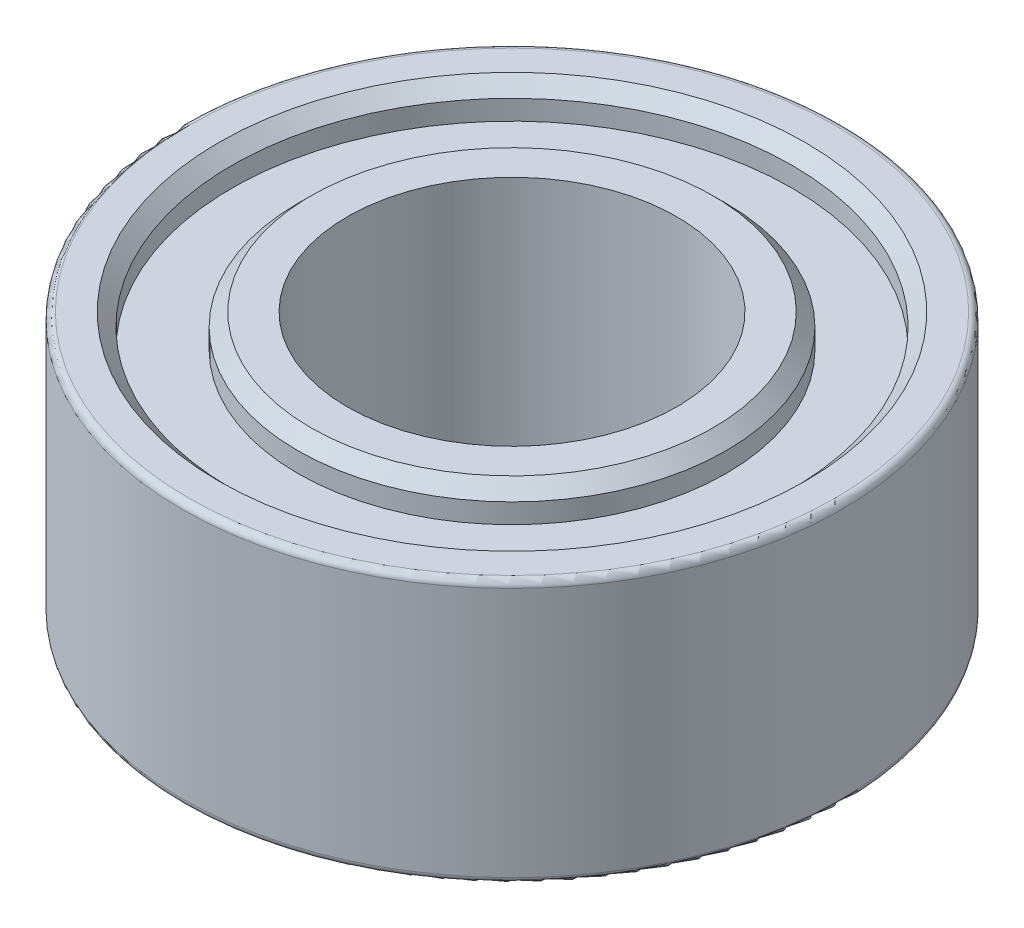
ISO-10303-21;
HEADER;
FILE_DESCRIPTION(('STEP AP214'),'2;1');
FILE_NAME('part.step','',(''),(''),'','','');
FILE_SCHEMA(('AUTOMOTIVE_DESIGN { 1 0 10303 214 1 1 1 1 }'));
ENDSEC;
DATA;
#1=APPLICATION_CONTEXT('core data for automotive mechanical design processes');
#2=APPLICATION_PROTOCOL_DEFINITION('international standard','automotive_design',2000,#1);
#3=PRODUCT_CONTEXT('',#1,'mechanical');
#4=PRODUCT('Part','Part','',(#3));
#5=PRODUCT_RELATED_PRODUCT_CATEGORY('part','',(#4));
#6=PRODUCT_DEFINITION_FORMATION('','',#4);
#7=PRODUCT_DEFINITION_CONTEXT('part definition',#1,'design');
#8=PRODUCT_DEFINITION('design','',#6,#7);
#9=PRODUCT_DEFINITION_SHAPE('','',#8);
#10=(LENGTH_UNIT() NAMED_UNIT(*) SI_UNIT(.MILLI.,.METRE.));
#11=(NAMED_UNIT(*) PLANE_ANGLE_UNIT() SI_UNIT($,.RADIAN.));
#12=(NAMED_UNIT(*) SI_UNIT($,.STERADIAN.) SOLID_ANGLE_UNIT());
#13=UNCERTAINTY_MEASURE_WITH_UNIT(LENGTH_MEASURE(1.E-05),#10,'distance_accuracy_value','');
#14=(GEOMETRIC_REPRESENTATION_CONTEXT(3) GLOBAL_UNCERTAINTY_ASSIGNED_CONTEXT((#13)) GLOBAL_UNIT_ASSIGNED_CONTEXT((#10,
#11,#12)) REPRESENTATION_CONTEXT('',''));
#15=CARTESIAN_POINT('',(0.,0.,0.));
#16=DIRECTION('',(0.,0.,1.));
#17=DIRECTION('',(1.,0.,0.));
#18=AXIS2_PLACEMENT_3D('',#15,#16,#17);
#19=CARTESIAN_POINT('',(0.,-2.,0.));
#20=DIRECTION('',(0.,1.,0.));
#21=DIRECTION('',(0.,0.,1.));
#22=AXIS2_PLACEMENT_3D('',#19,#20,#21);
#23=PLANE('',#22);
#24=CARTESIAN_POINT('',(0.,-2.,0.));
#25=DIRECTION('',(0.,1.,0.));
#26=DIRECTION('',(0.,0.,1.));
#27=AXIS2_PLACEMENT_3D('',#24,#25,#26);
#28=CIRCLE('',#27,3.05);
#29=CARTESIAN_POINT('',(0.,-2.,3.05));
#30=VERTEX_POINT('',#29);
#31=EDGE_CURVE('E79',#30,#30,#28,.F.);
#32=ORIENTED_EDGE('',*,*,#31,.T.);
#33=EDGE_LOOP('',(#32));
#34=FACE_BOUND('',#33,.T.);
#35=CARTESIAN_POINT('',(0.,-2.,0.));
#36=DIRECTION('',(0.,1.,0.));
#37=DIRECTION('',(0.,0.,1.));
#38=AXIS2_PLACEMENT_3D('',#35,#36,#37);
#39=CIRCLE('',#38,2.5);
#40=CARTESIAN_POINT('',(0.,-2.,2.5));
#41=VERTEX_POINT('',#40);
#42=EDGE_CURVE('E96',#41,#41,#39,.T.);
#43=ORIENTED_EDGE('',*,*,#42,.T.);
#44=EDGE_LOOP('',(#43));
#45=FACE_BOUND('',#44,.T.);
#46=ADVANCED_FACE('F39',(#34,#45),#23,.F.);
#47=CARTESIAN_POINT('',(0.,2.,0.));
#48=DIRECTION('',(0.,1.,0.));
#49=DIRECTION('',(0.,0.,1.));
#50=AXIS2_PLACEMENT_3D('',#47,#48,#49);
#51=PLANE('',#50);
#52=CARTESIAN_POINT('',(0.,2.,0.));
#53=DIRECTION('',(0.,1.,0.));
#54=DIRECTION('',(0.,0.,1.));
#55=AXIS2_PLACEMENT_3D('',#52,#53,#54);
#56=CIRCLE('',#55,3.05);
#57=CARTESIAN_POINT('',(0.,2.,3.05));
#58=VERTEX_POINT('',#57);
#59=EDGE_CURVE('E75',#58,#58,#56,.T.);
#60=ORIENTED_EDGE('',*,*,#59,.T.);
#61=EDGE_LOOP('',(#60));
#62=FACE_BOUND('',#61,.T.);
#63=CARTESIAN_POINT('',(0.,2.,0.));
#64=DIRECTION('',(0.,1.,0.));
#65=DIRECTION('',(0.,0.,1.));
#66=AXIS2_PLACEMENT_3D('',#63,#64,#65);
#67=CIRCLE('',#66,2.5);
#68=CARTESIAN_POINT('',(0.,2.,2.5));
#69=VERTEX_POINT('',#68);
#70=EDGE_CURVE('E95',#69,#69,#67,.T.);
#71=ORIENTED_EDGE('',*,*,#70,.F.);
#72=EDGE_LOOP('',(#71));
#73=FACE_BOUND('',#72,.T.);
#74=ADVANCED_FACE('F139',(#62,#73),#51,.T.);
#75=CARTESIAN_POINT('',(0.,2.,0.));
#76=DIRECTION('',(0.,1.,0.));
#77=DIRECTION('',(0.,0.,1.));
#78=AXIS2_PLACEMENT_3D('',#75,#76,#77);
#79=CIRCLE('',#78,4.9);
#80=CARTESIAN_POINT('',(0.,2.,4.9));
#81=VERTEX_POINT('',#80);
#82=EDGE_CURVE('E10',#81,#81,#79,.T.);
#83=ORIENTED_EDGE('',*,*,#82,.T.);
#84=EDGE_LOOP('',(#83));
#85=FACE_BOUND('',#84,.T.);
#86=CARTESIAN_POINT('',(0.,2.,0.));
#87=DIRECTION('',(0.,1.,0.));
#88=DIRECTION('',(0.,0.,1.));
#89=AXIS2_PLACEMENT_3D('',#86,#87,#88);
#90=CIRCLE('',#89,4.45);
#91=CARTESIAN_POINT('',(0.,2.,4.45));
#92=VERTEX_POINT('',#91);
#93=EDGE_CURVE('E63',#92,#92,#90,.F.);
#94=ORIENTED_EDGE('',*,*,#93,.T.);
#95=EDGE_LOOP('',(#94));
#96=FACE_BOUND('',#95,.T.);
#97=ADVANCED_FACE('F146',(#85,#96),#51,.T.);
#98=CARTESIAN_POINT('',(0.,-2.,0.));
#99=DIRECTION('',(0.,1.,0.));
#100=DIRECTION('',(0.,0.,1.));
#101=AXIS2_PLACEMENT_3D('',#98,#99,#100);
#102=CIRCLE('',#101,4.9);
#103=CARTESIAN_POINT('',(0.,-2.,4.9));
#104=VERTEX_POINT('',#103);
#105=EDGE_CURVE('E47',#104,#104,#102,.F.);
#106=ORIENTED_EDGE('',*,*,#105,.T.);
#107=EDGE_LOOP('',(#106));
#108=FACE_BOUND('',#107,.T.);
#109=CARTESIAN_POINT('',(0.,-2.,0.));
#110=DIRECTION('',(0.,1.,0.));
#111=DIRECTION('',(0.,0.,1.));
#112=AXIS2_PLACEMENT_3D('',#109,#110,#111);
#113=CIRCLE('',#112,4.45);
#114=CARTESIAN_POINT('',(0.,-2.,4.45));
#115=VERTEX_POINT('',#114);
#116=EDGE_CURVE('E91',#115,#115,#113,.T.);
#117=ORIENTED_EDGE('',*,*,#116,.T.);
#118=EDGE_LOOP('',(#117));
#119=FACE_BOUND('',#118,.T.);
#120=ADVANCED_FACE('F142',(#108,#119),#23,.F.);
#121=CARTESIAN_POINT('',(0.,2.,0.));
#122=DIRECTION('',(0.,-1.,0.));
#123=DIRECTION('',(0.,0.,-1.));
#124=AXIS2_PLACEMENT_3D('',#121,#122,#123);
#125=CYLINDRICAL_SURFACE('',#124,5.);
#126=CARTESIAN_POINT('',(0.,-1.9,0.));
#127=DIRECTION('',(0.,1.,0.));
#128=DIRECTION('',(0.,0.,1.));
#129=AXIS2_PLACEMENT_3D('',#126,#127,#128);
#130=CIRCLE('',#129,5.);
#131=CARTESIAN_POINT('',(0.,-1.9,5.));
#132=VERTEX_POINT('',#131);
#133=EDGE_CURVE('E52',#132,#132,#130,.T.);
#134=ORIENTED_EDGE('',*,*,#133,.T.);
#135=EDGE_LOOP('',(#134));
#136=FACE_BOUND('',#135,.T.);
#137=CARTESIAN_POINT('',(0.,1.9,0.));
#138=DIRECTION('',(0.,1.,0.));
#139=DIRECTION('',(0.,0.,1.));
#140=AXIS2_PLACEMENT_3D('',#137,#138,#139);
#141=CIRCLE('',#140,5.);
#142=CARTESIAN_POINT('',(0.,1.9,5.));
#143=VERTEX_POINT('',#142);
#144=EDGE_CURVE('E57',#143,#143,#141,.F.);
#145=ORIENTED_EDGE('',*,*,#144,.T.);
#146=EDGE_LOOP('',(#145));
#147=FACE_BOUND('',#146,.T.);
#148=ADVANCED_FACE('F152',(#136,#147),#125,.T.);
#149=CARTESIAN_POINT('',(0.,2.,0.));
#150=DIRECTION('',(0.,-1.,0.));
#151=DIRECTION('',(0.,0.,-1.));
#152=AXIS2_PLACEMENT_3D('',#149,#150,#151);
#153=CYLINDRICAL_SURFACE('',#152,2.5);
#154=ORIENTED_EDGE('',*,*,#70,.T.);
#155=EDGE_LOOP('',(#154));
#156=FACE_BOUND('',#155,.T.);
#157=ORIENTED_EDGE('',*,*,#42,.F.);
#158=EDGE_LOOP('',(#157));
#159=FACE_BOUND('',#158,.T.);
#160=ADVANCED_FACE('F157',(#156,#159),#153,.F.);
#161=CARTESIAN_POINT('',(0.,1.5,0.));
#162=DIRECTION('',(0.,1.,0.));
#163=DIRECTION('',(0.,0.,1.));
#164=AXIS2_PLACEMENT_3D('',#161,#162,#163);
#165=CYLINDRICAL_SURFACE('',#164,4.25);
#166=CARTESIAN_POINT('',(0.,1.8,0.));
#167=DIRECTION('',(0.,1.,0.));
#168=DIRECTION('',(0.,0.,1.));
#169=AXIS2_PLACEMENT_3D('',#166,#167,#168);
#170=CIRCLE('',#169,4.25);
#171=CARTESIAN_POINT('',(0.,1.8,4.25));
#172=VERTEX_POINT('',#171);
#173=EDGE_CURVE('E67',#172,#172,#170,.T.);
#174=ORIENTED_EDGE('',*,*,#173,.T.);
#175=EDGE_LOOP('',(#174));
#176=FACE_BOUND('',#175,.T.);
#177=CARTESIAN_POINT('',(0.,1.5,0.));
#178=DIRECTION('',(0.,1.,0.));
#179=DIRECTION('',(0.,0.,1.));
#180=AXIS2_PLACEMENT_3D('',#177,#178,#179);
#181=CIRCLE('',#180,4.25);
#182=CARTESIAN_POINT('',(0.,1.5,4.25));
#183=VERTEX_POINT('',#182);
#184=EDGE_CURVE('E100',#183,#183,#181,.T.);
#185=ORIENTED_EDGE('',*,*,#184,.F.);
#186=EDGE_LOOP('',(#185));
#187=FACE_BOUND('',#186,.T.);
#188=ADVANCED_FACE('F168',(#176,#187),#165,.F.);
#189=CARTESIAN_POINT('',(0.,1.5,0.));
#190=DIRECTION('',(0.,1.,0.));
#191=DIRECTION('',(0.,0.,1.));
#192=AXIS2_PLACEMENT_3D('',#189,#190,#191);
#193=PLANE('',#192);
#194=CARTESIAN_POINT('',(0.,1.5,0.));
#195=DIRECTION('',(0.,1.,0.));
#196=DIRECTION('',(0.,0.,1.));
#197=AXIS2_PLACEMENT_3D('',#194,#195,#196);
#198=CIRCLE('',#197,3.25);
#199=CARTESIAN_POINT('',(0.,1.5,3.25));
#200=VERTEX_POINT('',#199);
#201=EDGE_CURVE('E107',#200,#200,#198,.T.);
#202=ORIENTED_EDGE('',*,*,#201,.F.);
#203=EDGE_LOOP('',(#202));
#204=FACE_BOUND('',#203,.T.);
#205=ORIENTED_EDGE('',*,*,#184,.T.);
#206=EDGE_LOOP('',(#205));
#207=FACE_BOUND('',#206,.T.);
#208=ADVANCED_FACE('F172',(#204,#207),#193,.T.);
#209=CARTESIAN_POINT('',(0.,1.5,0.));
#210=DIRECTION('',(0.,1.,0.));
#211=DIRECTION('',(0.,0.,1.));
#212=AXIS2_PLACEMENT_3D('',#209,#210,#211);
#213=CYLINDRICAL_SURFACE('',#212,3.25);
#214=CARTESIAN_POINT('',(0.,1.8,0.));
#215=DIRECTION('',(0.,1.,0.));
#216=DIRECTION('',(0.,0.,1.));
#217=AXIS2_PLACEMENT_3D('',#214,#215,#216);
#218=CIRCLE('',#217,3.25);
#219=CARTESIAN_POINT('',(0.,1.8,3.25));
#220=VERTEX_POINT('',#219);
#221=EDGE_CURVE('E71',#220,#220,#218,.F.);
#222=ORIENTED_EDGE('',*,*,#221,.T.);
#223=EDGE_LOOP('',(#222));
#224=FACE_BOUND('',#223,.T.);
#225=ORIENTED_EDGE('',*,*,#201,.T.);
#226=EDGE_LOOP('',(#225));
#227=FACE_BOUND('',#226,.T.);
#228=ADVANCED_FACE('F176',(#224,#227),#213,.T.);
#229=CARTESIAN_POINT('',(0.,-1.5,0.));
#230=DIRECTION('',(0.,-1.,0.));
#231=DIRECTION('',(0.,0.,1.));
#232=AXIS2_PLACEMENT_3D('',#229,#230,#231);
#233=PLANE('',#232);
#234=CARTESIAN_POINT('',(0.,-1.5,0.));
#235=DIRECTION('',(0.,1.,0.));
#236=DIRECTION('',(0.,0.,1.));
#237=AXIS2_PLACEMENT_3D('',#234,#235,#236);
#238=CIRCLE('',#237,4.25);
#239=CARTESIAN_POINT('',(0.,-1.5,4.25));
#240=VERTEX_POINT('',#239);
#241=EDGE_CURVE('E111',#240,#240,#238,.T.);
#242=ORIENTED_EDGE('',*,*,#241,.F.);
#243=EDGE_LOOP('',(#242));
#244=FACE_BOUND('',#243,.T.);
#245=CARTESIAN_POINT('',(0.,-1.5,0.));
#246=DIRECTION('',(0.,1.,0.));
#247=DIRECTION('',(0.,0.,1.));
#248=AXIS2_PLACEMENT_3D('',#245,#246,#247);
#249=CIRCLE('',#248,3.25);
#250=CARTESIAN_POINT('',(0.,-1.5,3.25));
#251=VERTEX_POINT('',#250);
#252=EDGE_CURVE('E115',#251,#251,#249,.T.);
#253=ORIENTED_EDGE('',*,*,#252,.T.);
#254=EDGE_LOOP('',(#253));
#255=FACE_BOUND('',#254,.T.);
#256=ADVANCED_FACE('F120',(#244,#255),#233,.T.);
#257=CARTESIAN_POINT('',(0.,-1.5,0.));
#258=DIRECTION('',(0.,-1.,0.));
#259=DIRECTION('',(0.,0.,-1.));
#260=AXIS2_PLACEMENT_3D('',#257,#258,#259);
#261=CYLINDRICAL_SURFACE('',#260,4.25);
#262=CARTESIAN_POINT('',(0.,-1.8,0.));
#263=DIRECTION('',(0.,1.,0.));
#264=DIRECTION('',(0.,0.,1.));
#265=AXIS2_PLACEMENT_3D('',#262,#263,#264);
#266=CIRCLE('',#265,4.25);
#267=CARTESIAN_POINT('',(0.,-1.8,4.25));
#268=VERTEX_POINT('',#267);
#269=EDGE_CURVE('E87',#268,#268,#266,.F.);
#270=ORIENTED_EDGE('',*,*,#269,.T.);
#271=EDGE_LOOP('',(#270));
#272=FACE_BOUND('',#271,.T.);
#273=ORIENTED_EDGE('',*,*,#241,.T.);
#274=EDGE_LOOP('',(#273));
#275=FACE_BOUND('',#274,.T.);
#276=ADVANCED_FACE('F125',(#272,#275),#261,.F.);
#277=CARTESIAN_POINT('',(0.,-1.5,0.));
#278=DIRECTION('',(0.,-1.,0.));
#279=DIRECTION('',(0.,0.,-1.));
#280=AXIS2_PLACEMENT_3D('',#277,#278,#279);
#281=CYLINDRICAL_SURFACE('',#280,3.25);
#282=CARTESIAN_POINT('',(0.,-1.8,0.));
#283=DIRECTION('',(0.,1.,0.));
#284=DIRECTION('',(0.,0.,1.));
#285=AXIS2_PLACEMENT_3D('',#282,#283,#284);
#286=CIRCLE('',#285,3.25);
#287=CARTESIAN_POINT('',(0.,-1.8,3.25));
#288=VERTEX_POINT('',#287);
#289=EDGE_CURVE('E83',#288,#288,#286,.T.);
#290=ORIENTED_EDGE('',*,*,#289,.T.);
#291=EDGE_LOOP('',(#290));
#292=FACE_BOUND('',#291,.T.);
#293=ORIENTED_EDGE('',*,*,#252,.F.);
#294=EDGE_LOOP('',(#293));
#295=FACE_BOUND('',#294,.T.);
#296=ADVANCED_FACE('F122',(#292,#295),#281,.T.);
#297=CARTESIAN_POINT('',(0.,-2.,0.));
#298=DIRECTION('',(0.,-1.,0.));
#299=DIRECTION('',(0.,0.,-1.));
#300=AXIS2_PLACEMENT_3D('',#297,#298,#299);
#301=CONICAL_SURFACE('',#300,4.45,0.785398163397444);
#302=ORIENTED_EDGE('',*,*,#269,.F.);
#303=EDGE_LOOP('',(#302));
#304=FACE_BOUND('',#303,.T.);
#305=ORIENTED_EDGE('',*,*,#116,.F.);
#306=EDGE_LOOP('',(#305));
#307=FACE_BOUND('',#306,.T.);
#308=ADVANCED_FACE('F124',(#304,#307),#301,.F.);
#309=CARTESIAN_POINT('',(0.,-1.8,0.));
#310=DIRECTION('',(0.,1.,0.));
#311=DIRECTION('',(0.,0.,1.));
#312=AXIS2_PLACEMENT_3D('',#309,#310,#311);
#313=CONICAL_SURFACE('',#312,3.25,0.78539816339745);
#314=ORIENTED_EDGE('',*,*,#31,.F.);
#315=EDGE_LOOP('',(#314));
#316=FACE_BOUND('',#315,.T.);
#317=ORIENTED_EDGE('',*,*,#289,.F.);
#318=EDGE_LOOP('',(#317));
#319=FACE_BOUND('',#318,.T.);
#320=ADVANCED_FACE('F132',(#316,#319),#313,.T.);
#321=CARTESIAN_POINT('',(0.,2.,0.));
#322=DIRECTION('',(0.,-1.,0.));
#323=DIRECTION('',(0.,0.,-1.));
#324=AXIS2_PLACEMENT_3D('',#321,#322,#323);
#325=CONICAL_SURFACE('',#324,3.05,0.785398163397444);
#326=ORIENTED_EDGE('',*,*,#221,.F.);
#327=EDGE_LOOP('',(#326));
#328=FACE_BOUND('',#327,.T.);
#329=ORIENTED_EDGE('',*,*,#59,.F.);
#330=EDGE_LOOP('',(#329));
#331=FACE_BOUND('',#330,.T.);
#332=ADVANCED_FACE('F215',(#328,#331),#325,.T.);
#333=CARTESIAN_POINT('',(0.,1.8,0.));
#334=DIRECTION('',(0.,1.,0.));
#335=DIRECTION('',(0.,0.,1.));
#336=AXIS2_PLACEMENT_3D('',#333,#334,#335);
#337=CONICAL_SURFACE('',#336,4.25,0.785398163397453);
#338=ORIENTED_EDGE('',*,*,#93,.F.);
#339=EDGE_LOOP('',(#338));
#340=FACE_BOUND('',#339,.T.);
#341=ORIENTED_EDGE('',*,*,#173,.F.);
#342=EDGE_LOOP('',(#341));
#343=FACE_BOUND('',#342,.T.);
#344=ADVANCED_FACE('F225',(#340,#343),#337,.F.);
#345=CARTESIAN_POINT('',(0.,-1.9,0.));
#346=DIRECTION('',(0.,1.,0.));
#347=DIRECTION('',(0.,0.,1.));
#348=AXIS2_PLACEMENT_3D('',#345,#346,#347);
#349=TOROIDAL_SURFACE('',#348,4.9,0.1);
#350=ORIENTED_EDGE('',*,*,#105,.F.);
#351=EDGE_LOOP('',(#350));
#352=FACE_BOUND('',#351,.T.);
#353=ORIENTED_EDGE('',*,*,#133,.F.);
#354=EDGE_LOOP('',(#353));
#355=FACE_BOUND('',#354,.T.);
#356=ADVANCED_FACE('F234',(#352,#355),#349,.T.);
#357=CARTESIAN_POINT('',(0.,1.9,0.));
#358=DIRECTION('',(0.,1.,0.));
#359=DIRECTION('',(0.,0.,1.));
#360=AXIS2_PLACEMENT_3D('',#357,#358,#359);
#361=TOROIDAL_SURFACE('',#360,4.9,0.1);
#362=ORIENTED_EDGE('',*,*,#144,.F.);
#363=EDGE_LOOP('',(#362));
#364=FACE_BOUND('',#363,.T.);
#365=ORIENTED_EDGE('',*,*,#82,.F.);
#366=EDGE_LOOP('',(#365));
#367=FACE_BOUND('',#366,.T.);
#368=ADVANCED_FACE('F41',(#364,#367),#361,.T.);
#369=CLOSED_SHELL('',(#46,#74,#97,#120,#148,#160,#188,#208,#228,#256,#276,#296,#308,#320,#332,
#344,#356,#368));
#370=MANIFOLD_SOLID_BREP('B2',#369);
#371=ADVANCED_BREP_SHAPE_REPRESENTATION('',(#18,#370),#14);
#372=SHAPE_DEFINITION_REPRESENTATION(#9,#371);
ENDSEC;
END-ISO-10303-21;
